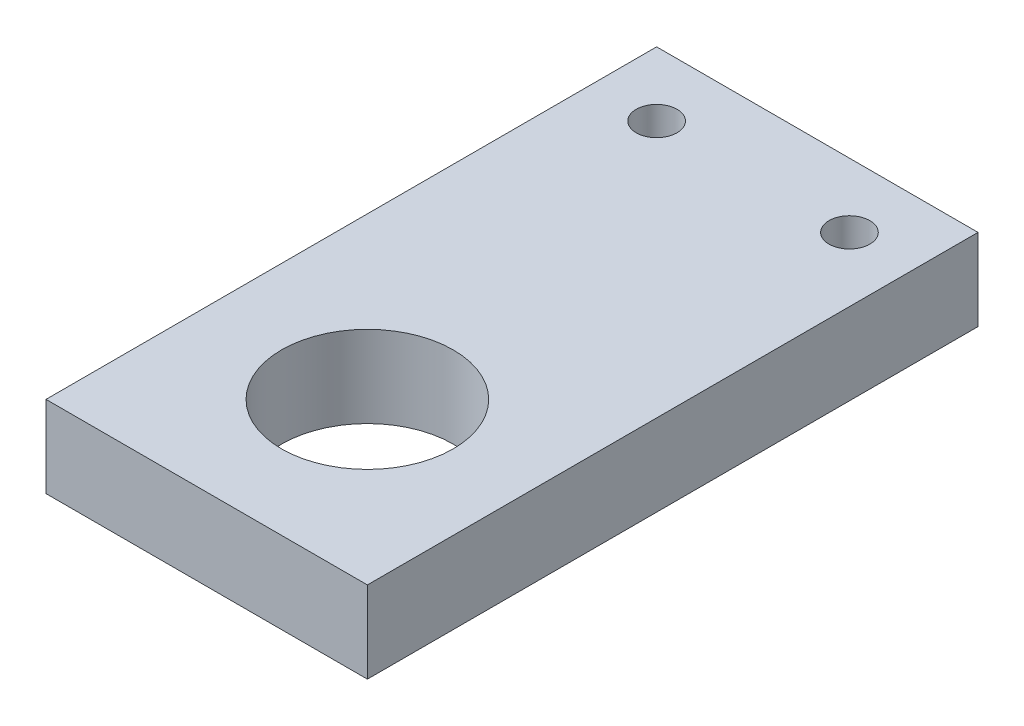
ISO-10303-21;
HEADER;
FILE_DESCRIPTION(('STEP AP214'),'2;1');
FILE_NAME('part.step','',(''),(''),'','','');
FILE_SCHEMA(('AUTOMOTIVE_DESIGN { 1 0 10303 214 1 1 1 1 }'));
ENDSEC;
DATA;
#1=APPLICATION_CONTEXT('core data for automotive mechanical design processes');
#2=APPLICATION_PROTOCOL_DEFINITION('international standard','automotive_design',2000,#1);
#3=PRODUCT_CONTEXT('',#1,'mechanical');
#4=PRODUCT('Part','Part','',(#3));
#5=PRODUCT_RELATED_PRODUCT_CATEGORY('part','',(#4));
#6=PRODUCT_DEFINITION_FORMATION('','',#4);
#7=PRODUCT_DEFINITION_CONTEXT('part definition',#1,'design');
#8=PRODUCT_DEFINITION('design','',#6,#7);
#9=PRODUCT_DEFINITION_SHAPE('','',#8);
#10=(LENGTH_UNIT() NAMED_UNIT(*) SI_UNIT(.MILLI.,.METRE.));
#11=(NAMED_UNIT(*) PLANE_ANGLE_UNIT() SI_UNIT($,.RADIAN.));
#12=(NAMED_UNIT(*) SI_UNIT($,.STERADIAN.) SOLID_ANGLE_UNIT());
#13=UNCERTAINTY_MEASURE_WITH_UNIT(LENGTH_MEASURE(1.E-05),#10,'distance_accuracy_value','');
#14=(GEOMETRIC_REPRESENTATION_CONTEXT(3) GLOBAL_UNCERTAINTY_ASSIGNED_CONTEXT((#13)) GLOBAL_UNIT_ASSIGNED_CONTEXT((#10,
#11,#12)) REPRESENTATION_CONTEXT('',''));
#15=CARTESIAN_POINT('',(0.,0.,0.));
#16=DIRECTION('',(0.,0.,1.));
#17=DIRECTION('',(1.,0.,0.));
#18=AXIS2_PLACEMENT_3D('',#15,#16,#17);
#19=CARTESIAN_POINT('',(0.,6.35,0.));
#20=DIRECTION('',(0.,-1.,0.));
#21=DIRECTION('',(0.,0.,-1.));
#22=AXIS2_PLACEMENT_3D('',#19,#20,#21);
#23=PLANE('',#22);
#24=CARTESIAN_POINT('',(20.,6.35,-42.5));
#25=DIRECTION('',(0.,1.,0.));
#26=DIRECTION('',(0.,0.,1.));
#27=AXIS2_PLACEMENT_3D('',#24,#25,#26);
#28=CIRCLE('',#27,1.5875);
#29=CARTESIAN_POINT('',(20.,6.35,-40.9125));
#30=VERTEX_POINT('',#29);
#31=EDGE_CURVE('E115',#30,#30,#28,.T.);
#32=ORIENTED_EDGE('',*,*,#31,.F.);
#33=EDGE_LOOP('',(#32));
#34=FACE_BOUND('',#33,.T.);
#35=CARTESIAN_POINT('',(5.,6.35,-42.5));
#36=DIRECTION('',(0.,1.,0.));
#37=DIRECTION('',(0.,0.,-1.));
#38=AXIS2_PLACEMENT_3D('',#35,#36,#37);
#39=CIRCLE('',#38,1.5875);
#40=CARTESIAN_POINT('',(5.,6.35,-44.0875));
#41=VERTEX_POINT('',#40);
#42=EDGE_CURVE('E121',#41,#41,#39,.T.);
#43=ORIENTED_EDGE('',*,*,#42,.F.);
#44=EDGE_LOOP('',(#43));
#45=FACE_BOUND('',#44,.T.);
#46=DIRECTION('',(0.,0.,1.));
#47=VECTOR('',#46,1.);
#48=CARTESIAN_POINT('',(0.,6.35,0.));
#49=LINE('',#48,#47);
#50=CARTESIAN_POINT('',(0.,6.35,-47.5));
#51=VERTEX_POINT('',#50);
#52=CARTESIAN_POINT('',(0.,6.35,0.));
#53=VERTEX_POINT('',#52);
#54=EDGE_CURVE('E85',#51,#53,#49,.T.);
#55=ORIENTED_EDGE('',*,*,#54,.T.);
#56=DIRECTION('',(1.,0.,0.));
#57=VECTOR('',#56,1.);
#58=CARTESIAN_POINT('',(0.,6.35,0.));
#59=LINE('',#58,#57);
#60=CARTESIAN_POINT('',(25.,6.35,0.));
#61=VERTEX_POINT('',#60);
#62=EDGE_CURVE('E80',#53,#61,#59,.T.);
#63=ORIENTED_EDGE('',*,*,#62,.T.);
#64=DIRECTION('',(0.,0.,-1.));
#65=VECTOR('',#64,1.);
#66=CARTESIAN_POINT('',(25.,6.35,0.));
#67=LINE('',#66,#65);
#68=CARTESIAN_POINT('',(25.,6.35,-47.5));
#69=VERTEX_POINT('',#68);
#70=EDGE_CURVE('E83',#61,#69,#67,.T.);
#71=ORIENTED_EDGE('',*,*,#70,.T.);
#72=DIRECTION('',(-1.,0.,0.));
#73=VECTOR('',#72,1.);
#74=CARTESIAN_POINT('',(0.,6.35,-47.5));
#75=LINE('',#74,#73);
#76=EDGE_CURVE('E50',#69,#51,#75,.T.);
#77=ORIENTED_EDGE('',*,*,#76,.T.);
#78=EDGE_LOOP('',(#55,#63,#71,#77));
#79=FACE_BOUND('',#78,.T.);
#80=CARTESIAN_POINT('',(12.5,6.35,-12.5));
#81=DIRECTION('',(0.,1.,0.));
#82=DIRECTION('',(0.,0.,1.));
#83=AXIS2_PLACEMENT_3D('',#80,#81,#82);
#84=CIRCLE('',#83,6.675);
#85=CARTESIAN_POINT('',(12.5,6.35,-5.825));
#86=VERTEX_POINT('',#85);
#87=EDGE_CURVE('E100',#86,#86,#84,.T.);
#88=ORIENTED_EDGE('',*,*,#87,.F.);
#89=EDGE_LOOP('',(#88));
#90=FACE_BOUND('',#89,.T.);
#91=ADVANCED_FACE('F33',(#34,#45,#79,#90),#23,.F.);
#92=CARTESIAN_POINT('',(0.,0.,0.));
#93=DIRECTION('',(0.,-1.,0.));
#94=DIRECTION('',(0.,0.,-1.));
#95=AXIS2_PLACEMENT_3D('',#92,#93,#94);
#96=PLANE('',#95);
#97=CARTESIAN_POINT('',(20.,0.,-42.5));
#98=DIRECTION('',(0.,-1.,0.));
#99=DIRECTION('',(0.,0.,-1.));
#100=AXIS2_PLACEMENT_3D('',#97,#98,#99);
#101=CIRCLE('',#100,1.5875);
#102=CARTESIAN_POINT('',(20.,0.,-44.0875));
#103=VERTEX_POINT('',#102);
#104=EDGE_CURVE('E124',#103,#103,#101,.F.);
#105=ORIENTED_EDGE('',*,*,#104,.T.);
#106=EDGE_LOOP('',(#105));
#107=FACE_BOUND('',#106,.T.);
#108=CARTESIAN_POINT('',(5.,0.,-42.5));
#109=DIRECTION('',(0.,-1.,0.));
#110=DIRECTION('',(0.,0.,-1.));
#111=AXIS2_PLACEMENT_3D('',#108,#109,#110);
#112=CIRCLE('',#111,1.5875);
#113=CARTESIAN_POINT('',(5.,0.,-44.0875));
#114=VERTEX_POINT('',#113);
#115=EDGE_CURVE('E118',#114,#114,#112,.F.);
#116=ORIENTED_EDGE('',*,*,#115,.T.);
#117=EDGE_LOOP('',(#116));
#118=FACE_BOUND('',#117,.T.);
#119=DIRECTION('',(0.,0.,1.));
#120=VECTOR('',#119,1.);
#121=CARTESIAN_POINT('',(0.,0.,0.));
#122=LINE('',#121,#120);
#123=CARTESIAN_POINT('',(0.,0.,-47.5));
#124=VERTEX_POINT('',#123);
#125=CARTESIAN_POINT('',(0.,0.,0.));
#126=VERTEX_POINT('',#125);
#127=EDGE_CURVE('E97',#124,#126,#122,.T.);
#128=ORIENTED_EDGE('',*,*,#127,.F.);
#129=DIRECTION('',(-1.,0.,0.));
#130=VECTOR('',#129,1.);
#131=CARTESIAN_POINT('',(0.,0.,-47.5));
#132=LINE('',#131,#130);
#133=CARTESIAN_POINT('',(25.,0.,-47.5));
#134=VERTEX_POINT('',#133);
#135=EDGE_CURVE('E73',#134,#124,#132,.T.);
#136=ORIENTED_EDGE('',*,*,#135,.F.);
#137=DIRECTION('',(0.,0.,-1.));
#138=VECTOR('',#137,1.);
#139=CARTESIAN_POINT('',(25.,0.,0.));
#140=LINE('',#139,#138);
#141=CARTESIAN_POINT('',(25.,0.,0.));
#142=VERTEX_POINT('',#141);
#143=EDGE_CURVE('E67',#142,#134,#140,.T.);
#144=ORIENTED_EDGE('',*,*,#143,.F.);
#145=DIRECTION('',(1.,0.,0.));
#146=VECTOR('',#145,1.);
#147=CARTESIAN_POINT('',(0.,0.,0.));
#148=LINE('',#147,#146);
#149=EDGE_CURVE('E89',#126,#142,#148,.T.);
#150=ORIENTED_EDGE('',*,*,#149,.F.);
#151=EDGE_LOOP('',(#128,#136,#144,#150));
#152=FACE_BOUND('',#151,.T.);
#153=CARTESIAN_POINT('',(12.5,0.,-12.5));
#154=DIRECTION('',(0.,1.,0.));
#155=DIRECTION('',(0.,0.,1.));
#156=AXIS2_PLACEMENT_3D('',#153,#154,#155);
#157=CIRCLE('',#156,6.675);
#158=CARTESIAN_POINT('',(12.5,0.,-5.825));
#159=VERTEX_POINT('',#158);
#160=EDGE_CURVE('E112',#159,#159,#157,.T.);
#161=ORIENTED_EDGE('',*,*,#160,.T.);
#162=EDGE_LOOP('',(#161));
#163=FACE_BOUND('',#162,.T.);
#164=ADVANCED_FACE('F108',(#107,#118,#152,#163),#96,.T.);
#165=CARTESIAN_POINT('',(0.,6.35,0.));
#166=DIRECTION('',(1.,0.,0.));
#167=DIRECTION('',(0.,0.,-1.));
#168=AXIS2_PLACEMENT_3D('',#165,#166,#167);
#169=PLANE('',#168);
#170=ORIENTED_EDGE('',*,*,#127,.T.);
#171=DIRECTION('',(0.,-1.,0.));
#172=VECTOR('',#171,1.);
#173=CARTESIAN_POINT('',(0.,6.35,0.));
#174=LINE('',#173,#172);
#175=EDGE_CURVE('E11',#53,#126,#174,.T.);
#176=ORIENTED_EDGE('',*,*,#175,.F.);
#177=ORIENTED_EDGE('',*,*,#54,.F.);
#178=DIRECTION('',(0.,-1.,0.));
#179=VECTOR('',#178,1.);
#180=CARTESIAN_POINT('',(0.,6.35,-47.5));
#181=LINE('',#180,#179);
#182=EDGE_CURVE('E93',#51,#124,#181,.T.);
#183=ORIENTED_EDGE('',*,*,#182,.T.);
#184=EDGE_LOOP('',(#170,#176,#177,#183));
#185=FACE_BOUND('',#184,.T.);
#186=ADVANCED_FACE('F35',(#185),#169,.F.);
#187=CARTESIAN_POINT('',(0.,6.35,0.));
#188=DIRECTION('',(0.,0.,-1.));
#189=DIRECTION('',(-1.,0.,0.));
#190=AXIS2_PLACEMENT_3D('',#187,#188,#189);
#191=PLANE('',#190);
#192=ORIENTED_EDGE('',*,*,#149,.T.);
#193=DIRECTION('',(0.,-1.,0.));
#194=VECTOR('',#193,1.);
#195=CARTESIAN_POINT('',(25.,6.35,0.));
#196=LINE('',#195,#194);
#197=EDGE_CURVE('E42',#61,#142,#196,.T.);
#198=ORIENTED_EDGE('',*,*,#197,.F.);
#199=ORIENTED_EDGE('',*,*,#62,.F.);
#200=ORIENTED_EDGE('',*,*,#175,.T.);
#201=EDGE_LOOP('',(#192,#198,#199,#200));
#202=FACE_BOUND('',#201,.T.);
#203=ADVANCED_FACE('F88',(#202),#191,.F.);
#204=CARTESIAN_POINT('',(25.,6.35,0.));
#205=DIRECTION('',(-1.,0.,0.));
#206=DIRECTION('',(0.,0.,1.));
#207=AXIS2_PLACEMENT_3D('',#204,#205,#206);
#208=PLANE('',#207);
#209=ORIENTED_EDGE('',*,*,#143,.T.);
#210=DIRECTION('',(0.,-1.,0.));
#211=VECTOR('',#210,1.);
#212=CARTESIAN_POINT('',(25.,6.35,-47.5));
#213=LINE('',#212,#211);
#214=EDGE_CURVE('E90',#69,#134,#213,.T.);
#215=ORIENTED_EDGE('',*,*,#214,.F.);
#216=ORIENTED_EDGE('',*,*,#70,.F.);
#217=ORIENTED_EDGE('',*,*,#197,.T.);
#218=EDGE_LOOP('',(#209,#215,#216,#217));
#219=FACE_BOUND('',#218,.T.);
#220=ADVANCED_FACE('F91',(#219),#208,.F.);
#221=CARTESIAN_POINT('',(0.,6.35,-47.5));
#222=DIRECTION('',(0.,0.,1.));
#223=DIRECTION('',(1.,0.,0.));
#224=AXIS2_PLACEMENT_3D('',#221,#222,#223);
#225=PLANE('',#224);
#226=ORIENTED_EDGE('',*,*,#135,.T.);
#227=ORIENTED_EDGE('',*,*,#182,.F.);
#228=ORIENTED_EDGE('',*,*,#76,.F.);
#229=ORIENTED_EDGE('',*,*,#214,.T.);
#230=EDGE_LOOP('',(#226,#227,#228,#229));
#231=FACE_BOUND('',#230,.T.);
#232=ADVANCED_FACE('F105',(#231),#225,.F.);
#233=CARTESIAN_POINT('',(12.5,6.35,-12.5));
#234=DIRECTION('',(0.,-1.,0.));
#235=DIRECTION('',(0.,0.,-1.));
#236=AXIS2_PLACEMENT_3D('',#233,#234,#235);
#237=CYLINDRICAL_SURFACE('',#236,6.675);
#238=ORIENTED_EDGE('',*,*,#87,.T.);
#239=EDGE_LOOP('',(#238));
#240=FACE_BOUND('',#239,.T.);
#241=ORIENTED_EDGE('',*,*,#160,.F.);
#242=EDGE_LOOP('',(#241));
#243=FACE_BOUND('',#242,.T.);
#244=ADVANCED_FACE('F139',(#240,#243),#237,.F.);
#245=CARTESIAN_POINT('',(5.,-0.00100000000000013,-42.5));
#246=DIRECTION('',(0.,1.,0.));
#247=DIRECTION('',(0.,0.,1.));
#248=AXIS2_PLACEMENT_3D('',#245,#246,#247);
#249=CYLINDRICAL_SURFACE('',#248,1.5875);
#250=ORIENTED_EDGE('',*,*,#115,.F.);
#251=EDGE_LOOP('',(#250));
#252=FACE_BOUND('',#251,.T.);
#253=ORIENTED_EDGE('',*,*,#42,.T.);
#254=EDGE_LOOP('',(#253));
#255=FACE_BOUND('',#254,.T.);
#256=ADVANCED_FACE('F137',(#252,#255),#249,.F.);
#257=CARTESIAN_POINT('',(20.,-0.00100000000000013,-42.5));
#258=DIRECTION('',(0.,1.,0.));
#259=DIRECTION('',(0.,0.,1.));
#260=AXIS2_PLACEMENT_3D('',#257,#258,#259);
#261=CYLINDRICAL_SURFACE('',#260,1.5875);
#262=ORIENTED_EDGE('',*,*,#104,.F.);
#263=EDGE_LOOP('',(#262));
#264=FACE_BOUND('',#263,.T.);
#265=ORIENTED_EDGE('',*,*,#31,.T.);
#266=EDGE_LOOP('',(#265));
#267=FACE_BOUND('',#266,.T.);
#268=ADVANCED_FACE('F130',(#264,#267),#261,.F.);
#269=CLOSED_SHELL('',(#91,#164,#186,#203,#220,#232,#244,#256,#268));
#270=MANIFOLD_SOLID_BREP('B2',#269);
#271=ADVANCED_BREP_SHAPE_REPRESENTATION('',(#18,#270),#14);
#272=SHAPE_DEFINITION_REPRESENTATION(#9,#271);
ENDSEC;
END-ISO-10303-21;
